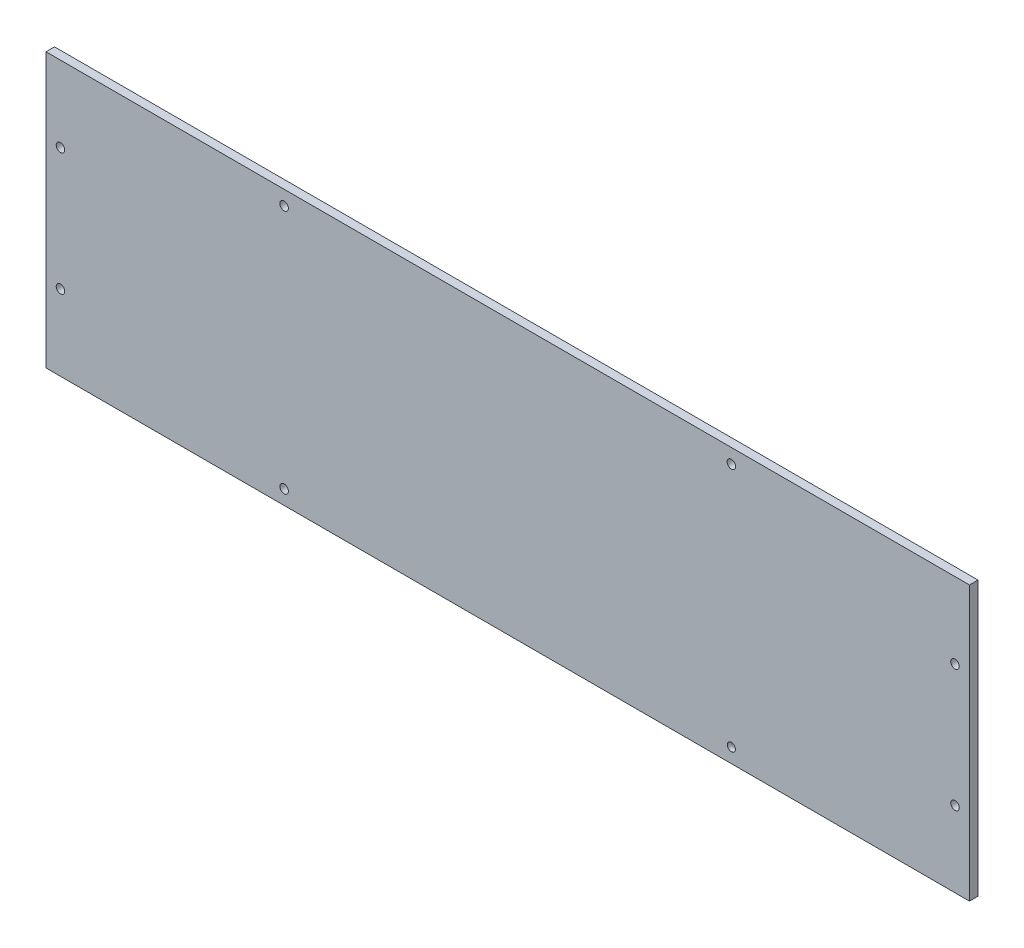
ISO-10303-21;
HEADER;
FILE_DESCRIPTION(('STEP AP214'),'2;1');
FILE_NAME('part.step','',(''),(''),'','','');
FILE_SCHEMA(('AUTOMOTIVE_DESIGN { 1 0 10303 214 1 1 1 1 }'));
ENDSEC;
DATA;
#1=APPLICATION_CONTEXT('core data for automotive mechanical design processes');
#2=APPLICATION_PROTOCOL_DEFINITION('international standard','automotive_design',2000,#1);
#3=PRODUCT_CONTEXT('',#1,'mechanical');
#4=PRODUCT('Part','Part','',(#3));
#5=PRODUCT_RELATED_PRODUCT_CATEGORY('part','',(#4));
#6=PRODUCT_DEFINITION_FORMATION('','',#4);
#7=PRODUCT_DEFINITION_CONTEXT('part definition',#1,'design');
#8=PRODUCT_DEFINITION('design','',#6,#7);
#9=PRODUCT_DEFINITION_SHAPE('','',#8);
#10=(LENGTH_UNIT() NAMED_UNIT(*) SI_UNIT(.MILLI.,.METRE.));
#11=(NAMED_UNIT(*) PLANE_ANGLE_UNIT() SI_UNIT($,.RADIAN.));
#12=(NAMED_UNIT(*) SI_UNIT($,.STERADIAN.) SOLID_ANGLE_UNIT());
#13=UNCERTAINTY_MEASURE_WITH_UNIT(LENGTH_MEASURE(1.E-05),#10,'distance_accuracy_value','');
#14=(GEOMETRIC_REPRESENTATION_CONTEXT(3) GLOBAL_UNCERTAINTY_ASSIGNED_CONTEXT((#13)) GLOBAL_UNIT_ASSIGNED_CONTEXT((#10,
#11,#12)) REPRESENTATION_CONTEXT('',''));
#15=CARTESIAN_POINT('',(0.,0.,0.));
#16=DIRECTION('',(0.,0.,1.));
#17=DIRECTION('',(1.,0.,0.));
#18=AXIS2_PLACEMENT_3D('',#15,#16,#17);
#19=CARTESIAN_POINT('',(0.,0.,0.));
#20=DIRECTION('',(0.,0.,1.));
#21=DIRECTION('',(1.,0.,0.));
#22=AXIS2_PLACEMENT_3D('',#19,#20,#21);
#23=PLANE('',#22);
#24=CARTESIAN_POINT('',(83.79402995,91.2808,0.));
#25=DIRECTION('',(0.,0.,1.));
#26=DIRECTION('',(1.,0.,0.));
#27=AXIS2_PLACEMENT_3D('',#24,#25,#26);
#28=CIRCLE('',#27,1.5);
#29=CARTESIAN_POINT('',(85.29402995,91.2808,0.));
#30=VERTEX_POINT('',#29);
#31=EDGE_CURVE('E104',#30,#30,#28,.T.);
#32=ORIENTED_EDGE('',*,*,#31,.T.);
#33=EDGE_LOOP('',(#32));
#34=FACE_BOUND('',#33,.T.);
#35=CARTESIAN_POINT('',(241.19467665,91.2808,0.));
#36=DIRECTION('',(0.,0.,1.));
#37=DIRECTION('',(1.,0.,0.));
#38=AXIS2_PLACEMENT_3D('',#35,#36,#37);
#39=CIRCLE('',#38,1.5);
#40=CARTESIAN_POINT('',(242.69467665,91.2808,0.));
#41=VERTEX_POINT('',#40);
#42=EDGE_CURVE('E121',#41,#41,#39,.T.);
#43=ORIENTED_EDGE('',*,*,#42,.T.);
#44=EDGE_LOOP('',(#43));
#45=FACE_BOUND('',#44,.T.);
#46=CARTESIAN_POINT('',(319.895,69.7305816,0.));
#47=DIRECTION('',(0.,0.,1.));
#48=DIRECTION('',(1.,0.,0.));
#49=AXIS2_PLACEMENT_3D('',#46,#47,#48);
#50=CIRCLE('',#49,1.50000000000002);
#51=CARTESIAN_POINT('',(321.395,69.7305816,0.));
#52=VERTEX_POINT('',#51);
#53=EDGE_CURVE('E118',#52,#52,#50,.T.);
#54=ORIENTED_EDGE('',*,*,#53,.T.);
#55=EDGE_LOOP('',(#54));
#56=FACE_BOUND('',#55,.T.);
#57=CARTESIAN_POINT('',(319.895,26.6301448000001,0.));
#58=DIRECTION('',(0.,0.,1.));
#59=DIRECTION('',(1.,0.,0.));
#60=AXIS2_PLACEMENT_3D('',#57,#58,#59);
#61=CIRCLE('',#60,1.50000000000002);
#62=CARTESIAN_POINT('',(321.395,26.6301448000001,0.));
#63=VERTEX_POINT('',#62);
#64=EDGE_CURVE('E115',#63,#63,#61,.T.);
#65=ORIENTED_EDGE('',*,*,#64,.T.);
#66=EDGE_LOOP('',(#65));
#67=FACE_BOUND('',#66,.T.);
#68=CARTESIAN_POINT('',(241.19467665,5.0799264,0.));
#69=DIRECTION('',(0.,0.,1.));
#70=DIRECTION('',(1.,0.,0.));
#71=AXIS2_PLACEMENT_3D('',#68,#69,#70);
#72=CIRCLE('',#71,1.5);
#73=CARTESIAN_POINT('',(242.69467665,5.0799264,0.));
#74=VERTEX_POINT('',#73);
#75=EDGE_CURVE('E112',#74,#74,#72,.T.);
#76=ORIENTED_EDGE('',*,*,#75,.T.);
#77=EDGE_LOOP('',(#76));
#78=FACE_BOUND('',#77,.T.);
#79=CARTESIAN_POINT('',(83.79402995,5.0799264,0.));
#80=DIRECTION('',(0.,0.,1.));
#81=DIRECTION('',(1.,0.,0.));
#82=AXIS2_PLACEMENT_3D('',#79,#80,#81);
#83=CIRCLE('',#82,1.5);
#84=CARTESIAN_POINT('',(85.29402995,5.0799264,0.));
#85=VERTEX_POINT('',#84);
#86=EDGE_CURVE('E109',#85,#85,#83,.T.);
#87=ORIENTED_EDGE('',*,*,#86,.T.);
#88=EDGE_LOOP('',(#87));
#89=FACE_BOUND('',#88,.T.);
#90=CARTESIAN_POINT('',(5.0937066,26.6301448,0.));
#91=DIRECTION('',(0.,0.,1.));
#92=DIRECTION('',(1.,0.,0.));
#93=AXIS2_PLACEMENT_3D('',#90,#91,#92);
#94=CIRCLE('',#93,1.5);
#95=CARTESIAN_POINT('',(6.5937066,26.6301448,0.));
#96=VERTEX_POINT('',#95);
#97=EDGE_CURVE('E105',#96,#96,#94,.T.);
#98=ORIENTED_EDGE('',*,*,#97,.T.);
#99=EDGE_LOOP('',(#98));
#100=FACE_BOUND('',#99,.T.);
#101=CARTESIAN_POINT('',(5.09370659999997,69.7305816,0.));
#102=DIRECTION('',(0.,0.,1.));
#103=DIRECTION('',(1.,0.,0.));
#104=AXIS2_PLACEMENT_3D('',#101,#102,#103);
#105=CIRCLE('',#104,1.5);
#106=CARTESIAN_POINT('',(6.59370659999997,69.7305816,0.));
#107=VERTEX_POINT('',#106);
#108=EDGE_CURVE('E108',#107,#107,#105,.T.);
#109=ORIENTED_EDGE('',*,*,#108,.T.);
#110=EDGE_LOOP('',(#109));
#111=FACE_BOUND('',#110,.T.);
#112=DIRECTION('',(0.,-1.,0.));
#113=VECTOR('',#112,1.);
#114=CARTESIAN_POINT('',(0.,0.,0.));
#115=LINE('',#114,#113);
#116=CARTESIAN_POINT('',(0.,96.3745066000003,0.));
#117=VERTEX_POINT('',#116);
#118=CARTESIAN_POINT('',(0.,0.,0.));
#119=VERTEX_POINT('',#118);
#120=EDGE_CURVE('E77',#117,#119,#115,.T.);
#121=ORIENTED_EDGE('',*,*,#120,.F.);
#122=DIRECTION('',(-1.,0.,0.));
#123=VECTOR('',#122,1.);
#124=CARTESIAN_POINT('',(0.,96.3745066000003,0.));
#125=LINE('',#124,#123);
#126=CARTESIAN_POINT('',(324.9887066,96.3745066000003,0.));
#127=VERTEX_POINT('',#126);
#128=EDGE_CURVE('E82',#127,#117,#125,.T.);
#129=ORIENTED_EDGE('',*,*,#128,.F.);
#130=DIRECTION('',(0.,1.,0.));
#131=VECTOR('',#130,1.);
#132=CARTESIAN_POINT('',(324.9887066,0.,0.));
#133=LINE('',#132,#131);
#134=CARTESIAN_POINT('',(324.9887066,0.,0.));
#135=VERTEX_POINT('',#134);
#136=EDGE_CURVE('E134',#135,#127,#133,.T.);
#137=ORIENTED_EDGE('',*,*,#136,.F.);
#138=DIRECTION('',(1.,0.,0.));
#139=VECTOR('',#138,1.);
#140=CARTESIAN_POINT('',(0.,0.,0.));
#141=LINE('',#140,#139);
#142=EDGE_CURVE('E132',#119,#135,#141,.T.);
#143=ORIENTED_EDGE('',*,*,#142,.F.);
#144=EDGE_LOOP('',(#121,#129,#137,#143));
#145=FACE_BOUND('',#144,.T.);
#146=ADVANCED_FACE('F35',(#34,#45,#56,#67,#78,#89,#100,#111,#145),#23,.F.);
#147=CARTESIAN_POINT('',(0.,0.,0.));
#148=DIRECTION('',(-1.,0.,0.));
#149=DIRECTION('',(0.,0.,1.));
#150=AXIS2_PLACEMENT_3D('',#147,#148,#149);
#151=PLANE('',#150);
#152=DIRECTION('',(0.,0.,1.));
#153=VECTOR('',#152,1.);
#154=CARTESIAN_POINT('',(0.,0.,0.));
#155=LINE('',#154,#153);
#156=CARTESIAN_POINT('',(0.,0.,3.));
#157=VERTEX_POINT('',#156);
#158=EDGE_CURVE('E38',#119,#157,#155,.T.);
#159=ORIENTED_EDGE('',*,*,#158,.T.);
#160=DIRECTION('',(0.,-1.,0.));
#161=VECTOR('',#160,1.);
#162=CARTESIAN_POINT('',(0.,96.3745066000003,3.));
#163=LINE('',#162,#161);
#164=CARTESIAN_POINT('',(0.,96.3745066000003,3.));
#165=VERTEX_POINT('',#164);
#166=EDGE_CURVE('E76',#165,#157,#163,.T.);
#167=ORIENTED_EDGE('',*,*,#166,.F.);
#168=DIRECTION('',(0.,0.,1.));
#169=VECTOR('',#168,1.);
#170=CARTESIAN_POINT('',(0.,96.3745066000003,0.));
#171=LINE('',#170,#169);
#172=EDGE_CURVE('E11',#117,#165,#171,.T.);
#173=ORIENTED_EDGE('',*,*,#172,.F.);
#174=ORIENTED_EDGE('',*,*,#120,.T.);
#175=EDGE_LOOP('',(#159,#167,#173,#174));
#176=FACE_BOUND('',#175,.T.);
#177=ADVANCED_FACE('F74',(#176),#151,.T.);
#178=CARTESIAN_POINT('',(0.,96.3745066000003,0.));
#179=DIRECTION('',(0.,1.,0.));
#180=DIRECTION('',(0.,0.,1.));
#181=AXIS2_PLACEMENT_3D('',#178,#179,#180);
#182=PLANE('',#181);
#183=ORIENTED_EDGE('',*,*,#172,.T.);
#184=DIRECTION('',(-1.,0.,0.));
#185=VECTOR('',#184,1.);
#186=CARTESIAN_POINT('',(0.,96.3745066000003,3.));
#187=LINE('',#186,#185);
#188=CARTESIAN_POINT('',(324.9887066,96.3745066000003,3.));
#189=VERTEX_POINT('',#188);
#190=EDGE_CURVE('E94',#189,#165,#187,.T.);
#191=ORIENTED_EDGE('',*,*,#190,.F.);
#192=DIRECTION('',(0.,0.,1.));
#193=VECTOR('',#192,1.);
#194=CARTESIAN_POINT('',(324.9887066,96.3745066000003,0.));
#195=LINE('',#194,#193);
#196=EDGE_CURVE('E43',#127,#189,#195,.T.);
#197=ORIENTED_EDGE('',*,*,#196,.F.);
#198=ORIENTED_EDGE('',*,*,#128,.T.);
#199=EDGE_LOOP('',(#183,#191,#197,#198));
#200=FACE_BOUND('',#199,.T.);
#201=ADVANCED_FACE('F141',(#200),#182,.T.);
#202=CARTESIAN_POINT('',(324.9887066,0.,0.));
#203=DIRECTION('',(1.,0.,0.));
#204=DIRECTION('',(0.,0.,-1.));
#205=AXIS2_PLACEMENT_3D('',#202,#203,#204);
#206=PLANE('',#205);
#207=ORIENTED_EDGE('',*,*,#196,.T.);
#208=DIRECTION('',(0.,1.,0.));
#209=VECTOR('',#208,1.);
#210=CARTESIAN_POINT('',(324.9887066,96.3745066000003,3.));
#211=LINE('',#210,#209);
#212=CARTESIAN_POINT('',(324.9887066,0.,3.));
#213=VERTEX_POINT('',#212);
#214=EDGE_CURVE('E89',#213,#189,#211,.T.);
#215=ORIENTED_EDGE('',*,*,#214,.F.);
#216=DIRECTION('',(0.,0.,1.));
#217=VECTOR('',#216,1.);
#218=CARTESIAN_POINT('',(324.9887066,0.,0.));
#219=LINE('',#218,#217);
#220=EDGE_CURVE('E81',#135,#213,#219,.T.);
#221=ORIENTED_EDGE('',*,*,#220,.F.);
#222=ORIENTED_EDGE('',*,*,#136,.T.);
#223=EDGE_LOOP('',(#207,#215,#221,#222));
#224=FACE_BOUND('',#223,.T.);
#225=ADVANCED_FACE('F138',(#224),#206,.T.);
#226=CARTESIAN_POINT('',(0.,0.,0.));
#227=DIRECTION('',(0.,-1.,0.));
#228=DIRECTION('',(0.,0.,-1.));
#229=AXIS2_PLACEMENT_3D('',#226,#227,#228);
#230=PLANE('',#229);
#231=ORIENTED_EDGE('',*,*,#220,.T.);
#232=DIRECTION('',(1.,0.,0.));
#233=VECTOR('',#232,1.);
#234=CARTESIAN_POINT('',(0.,0.,3.));
#235=LINE('',#234,#233);
#236=EDGE_CURVE('E84',#157,#213,#235,.T.);
#237=ORIENTED_EDGE('',*,*,#236,.F.);
#238=ORIENTED_EDGE('',*,*,#158,.F.);
#239=ORIENTED_EDGE('',*,*,#142,.T.);
#240=EDGE_LOOP('',(#231,#237,#238,#239));
#241=FACE_BOUND('',#240,.T.);
#242=ADVANCED_FACE('F85',(#241),#230,.T.);
#243=CARTESIAN_POINT('',(5.09370659999997,69.7305816,2.54));
#244=DIRECTION('',(0.,0.,-1.));
#245=DIRECTION('',(-1.,0.,0.));
#246=AXIS2_PLACEMENT_3D('',#243,#244,#245);
#247=CYLINDRICAL_SURFACE('',#246,1.5);
#248=ORIENTED_EDGE('',*,*,#108,.F.);
#249=EDGE_LOOP('',(#248));
#250=FACE_BOUND('',#249,.T.);
#251=CARTESIAN_POINT('',(5.09370659999997,69.7305816,3.));
#252=DIRECTION('',(0.,0.,1.));
#253=DIRECTION('',(1.,0.,0.));
#254=AXIS2_PLACEMENT_3D('',#251,#252,#253);
#255=CIRCLE('',#254,1.5);
#256=CARTESIAN_POINT('',(6.59370659999997,69.7305816,3.));
#257=VERTEX_POINT('',#256);
#258=EDGE_CURVE('E172',#257,#257,#255,.T.);
#259=ORIENTED_EDGE('',*,*,#258,.T.);
#260=EDGE_LOOP('',(#259));
#261=FACE_BOUND('',#260,.T.);
#262=ADVANCED_FACE('F165',(#250,#261),#247,.F.);
#263=CARTESIAN_POINT('',(5.0937066,26.6301448,2.54));
#264=DIRECTION('',(0.,0.,-1.));
#265=DIRECTION('',(-1.,0.,0.));
#266=AXIS2_PLACEMENT_3D('',#263,#264,#265);
#267=CYLINDRICAL_SURFACE('',#266,1.5);
#268=ORIENTED_EDGE('',*,*,#97,.F.);
#269=EDGE_LOOP('',(#268));
#270=FACE_BOUND('',#269,.T.);
#271=CARTESIAN_POINT('',(5.0937066,26.6301448,3.));
#272=DIRECTION('',(0.,0.,1.));
#273=DIRECTION('',(1.,0.,0.));
#274=AXIS2_PLACEMENT_3D('',#271,#272,#273);
#275=CIRCLE('',#274,1.5);
#276=CARTESIAN_POINT('',(6.5937066,26.6301448,3.));
#277=VERTEX_POINT('',#276);
#278=EDGE_CURVE('E182',#277,#277,#275,.T.);
#279=ORIENTED_EDGE('',*,*,#278,.T.);
#280=EDGE_LOOP('',(#279));
#281=FACE_BOUND('',#280,.T.);
#282=ADVANCED_FACE('F168',(#270,#281),#267,.F.);
#283=CARTESIAN_POINT('',(83.79402995,5.0799264,2.54));
#284=DIRECTION('',(0.,0.,-1.));
#285=DIRECTION('',(-1.,0.,0.));
#286=AXIS2_PLACEMENT_3D('',#283,#284,#285);
#287=CYLINDRICAL_SURFACE('',#286,1.5);
#288=ORIENTED_EDGE('',*,*,#86,.F.);
#289=EDGE_LOOP('',(#288));
#290=FACE_BOUND('',#289,.T.);
#291=CARTESIAN_POINT('',(83.79402995,5.0799264,3.));
#292=DIRECTION('',(0.,0.,1.));
#293=DIRECTION('',(1.,0.,0.));
#294=AXIS2_PLACEMENT_3D('',#291,#292,#293);
#295=CIRCLE('',#294,1.5);
#296=CARTESIAN_POINT('',(85.29402995,5.0799264,3.));
#297=VERTEX_POINT('',#296);
#298=EDGE_CURVE('E177',#297,#297,#295,.T.);
#299=ORIENTED_EDGE('',*,*,#298,.T.);
#300=EDGE_LOOP('',(#299));
#301=FACE_BOUND('',#300,.T.);
#302=ADVANCED_FACE('F207',(#290,#301),#287,.F.);
#303=CARTESIAN_POINT('',(241.19467665,5.0799264,2.54));
#304=DIRECTION('',(0.,0.,-1.));
#305=DIRECTION('',(-1.,0.,0.));
#306=AXIS2_PLACEMENT_3D('',#303,#304,#305);
#307=CYLINDRICAL_SURFACE('',#306,1.5);
#308=CARTESIAN_POINT('',(241.19467665,5.0799264,1.5));
#309=DIRECTION('',(0.,0.,1.));
#310=DIRECTION('',(1.,0.,0.));
#311=AXIS2_PLACEMENT_3D('',#308,#309,#310);
#312=CIRCLE('',#311,1.5);
#313=CARTESIAN_POINT('',(242.69467665,5.0799264,1.5));
#314=VERTEX_POINT('',#313);
#315=EDGE_CURVE('E128',#314,#314,#312,.F.);
#316=ORIENTED_EDGE('',*,*,#315,.F.);
#317=EDGE_LOOP('',(#316));
#318=FACE_BOUND('',#317,.T.);
#319=ORIENTED_EDGE('',*,*,#75,.F.);
#320=EDGE_LOOP('',(#319));
#321=FACE_BOUND('',#320,.T.);
#322=ADVANCED_FACE('F209',(#318,#321),#307,.F.);
#323=CARTESIAN_POINT('',(319.895,26.6301448000001,2.54));
#324=DIRECTION('',(0.,0.,-1.));
#325=DIRECTION('',(-1.,0.,0.));
#326=AXIS2_PLACEMENT_3D('',#323,#324,#325);
#327=CYLINDRICAL_SURFACE('',#326,1.50000000000002);
#328=ORIENTED_EDGE('',*,*,#64,.F.);
#329=EDGE_LOOP('',(#328));
#330=FACE_BOUND('',#329,.T.);
#331=CARTESIAN_POINT('',(319.895,26.6301448000001,3.));
#332=DIRECTION('',(0.,0.,1.));
#333=DIRECTION('',(1.,0.,0.));
#334=AXIS2_PLACEMENT_3D('',#331,#332,#333);
#335=CIRCLE('',#334,1.50000000000002);
#336=CARTESIAN_POINT('',(321.395,26.6301448000001,3.));
#337=VERTEX_POINT('',#336);
#338=EDGE_CURVE('E98',#337,#337,#335,.T.);
#339=ORIENTED_EDGE('',*,*,#338,.T.);
#340=EDGE_LOOP('',(#339));
#341=FACE_BOUND('',#340,.T.);
#342=ADVANCED_FACE('F196',(#330,#341),#327,.F.);
#343=CARTESIAN_POINT('',(319.895,69.7305816,2.54));
#344=DIRECTION('',(0.,0.,-1.));
#345=DIRECTION('',(-1.,0.,0.));
#346=AXIS2_PLACEMENT_3D('',#343,#344,#345);
#347=CYLINDRICAL_SURFACE('',#346,1.50000000000002);
#348=ORIENTED_EDGE('',*,*,#53,.F.);
#349=EDGE_LOOP('',(#348));
#350=FACE_BOUND('',#349,.T.);
#351=CARTESIAN_POINT('',(319.895,69.7305816,3.));
#352=DIRECTION('',(0.,0.,1.));
#353=DIRECTION('',(1.,0.,0.));
#354=AXIS2_PLACEMENT_3D('',#351,#352,#353);
#355=CIRCLE('',#354,1.50000000000002);
#356=CARTESIAN_POINT('',(321.395,69.7305816,3.));
#357=VERTEX_POINT('',#356);
#358=EDGE_CURVE('E95',#357,#357,#355,.T.);
#359=ORIENTED_EDGE('',*,*,#358,.T.);
#360=EDGE_LOOP('',(#359));
#361=FACE_BOUND('',#360,.T.);
#362=ADVANCED_FACE('F223',(#350,#361),#347,.F.);
#363=CARTESIAN_POINT('',(241.19467665,91.2808,2.54));
#364=DIRECTION('',(0.,0.,-1.));
#365=DIRECTION('',(-1.,0.,0.));
#366=AXIS2_PLACEMENT_3D('',#363,#364,#365);
#367=CYLINDRICAL_SURFACE('',#366,1.5);
#368=ORIENTED_EDGE('',*,*,#42,.F.);
#369=EDGE_LOOP('',(#368));
#370=FACE_BOUND('',#369,.T.);
#371=CARTESIAN_POINT('',(241.19467665,91.2808,3.));
#372=DIRECTION('',(0.,0.,1.));
#373=DIRECTION('',(1.,0.,0.));
#374=AXIS2_PLACEMENT_3D('',#371,#372,#373);
#375=CIRCLE('',#374,1.50000000000002);
#376=CARTESIAN_POINT('',(242.69467665,91.2808,3.));
#377=VERTEX_POINT('',#376);
#378=EDGE_CURVE('E185',#377,#377,#375,.T.);
#379=ORIENTED_EDGE('',*,*,#378,.T.);
#380=EDGE_LOOP('',(#379));
#381=FACE_BOUND('',#380,.T.);
#382=ADVANCED_FACE('F227',(#370,#381),#367,.F.);
#383=CARTESIAN_POINT('',(83.79402995,91.2808,2.54));
#384=DIRECTION('',(0.,0.,-1.));
#385=DIRECTION('',(-1.,0.,0.));
#386=AXIS2_PLACEMENT_3D('',#383,#384,#385);
#387=CYLINDRICAL_SURFACE('',#386,1.5);
#388=ORIENTED_EDGE('',*,*,#31,.F.);
#389=EDGE_LOOP('',(#388));
#390=FACE_BOUND('',#389,.T.);
#391=CARTESIAN_POINT('',(83.79402995,91.2808,3.));
#392=DIRECTION('',(0.,0.,1.));
#393=DIRECTION('',(1.,0.,0.));
#394=AXIS2_PLACEMENT_3D('',#391,#392,#393);
#395=CIRCLE('',#394,1.5);
#396=CARTESIAN_POINT('',(85.29402995,91.2808,3.));
#397=VERTEX_POINT('',#396);
#398=EDGE_CURVE('E174',#397,#397,#395,.T.);
#399=ORIENTED_EDGE('',*,*,#398,.T.);
#400=EDGE_LOOP('',(#399));
#401=FACE_BOUND('',#400,.T.);
#402=ADVANCED_FACE('F231',(#390,#401),#387,.F.);
#403=CARTESIAN_POINT('',(0.,0.,1.5));
#404=DIRECTION('',(0.,0.,1.));
#405=DIRECTION('',(1.,0.,0.));
#406=AXIS2_PLACEMENT_3D('',#403,#404,#405);
#407=PLANE('',#406);
#408=CARTESIAN_POINT('',(241.19467665,5.0799264,1.5));
#409=DIRECTION('',(0.,0.,1.));
#410=DIRECTION('',(1.,0.,0.));
#411=AXIS2_PLACEMENT_3D('',#408,#409,#410);
#412=CIRCLE('',#411,1.43796867212764);
#413=CARTESIAN_POINT('',(242.632645322128,5.0799264,1.5));
#414=VERTEX_POINT('',#413);
#415=EDGE_CURVE('E188',#414,#414,#412,.T.);
#416=ORIENTED_EDGE('',*,*,#415,.T.);
#417=EDGE_LOOP('',(#416));
#418=FACE_BOUND('',#417,.T.);
#419=ORIENTED_EDGE('',*,*,#315,.T.);
#420=EDGE_LOOP('',(#419));
#421=FACE_BOUND('',#420,.T.);
#422=ADVANCED_FACE('F200',(#418,#421),#407,.F.);
#423=CARTESIAN_POINT('',(0.,0.,3.));
#424=DIRECTION('',(0.,0.,1.));
#425=DIRECTION('',(1.,0.,0.));
#426=AXIS2_PLACEMENT_3D('',#423,#424,#425);
#427=PLANE('',#426);
#428=ORIENTED_EDGE('',*,*,#398,.F.);
#429=EDGE_LOOP('',(#428));
#430=FACE_BOUND('',#429,.T.);
#431=ORIENTED_EDGE('',*,*,#278,.F.);
#432=EDGE_LOOP('',(#431));
#433=FACE_BOUND('',#432,.T.);
#434=CARTESIAN_POINT('',(241.19467665,5.0799264,3.));
#435=DIRECTION('',(0.,0.,1.));
#436=DIRECTION('',(1.,0.,0.));
#437=AXIS2_PLACEMENT_3D('',#434,#435,#436);
#438=CIRCLE('',#437,1.43796867212764);
#439=CARTESIAN_POINT('',(242.632645322128,5.0799264,3.));
#440=VERTEX_POINT('',#439);
#441=EDGE_CURVE('E189',#440,#440,#438,.T.);
#442=ORIENTED_EDGE('',*,*,#441,.F.);
#443=EDGE_LOOP('',(#442));
#444=FACE_BOUND('',#443,.T.);
#445=ORIENTED_EDGE('',*,*,#358,.F.);
#446=EDGE_LOOP('',(#445));
#447=FACE_BOUND('',#446,.T.);
#448=ORIENTED_EDGE('',*,*,#166,.T.);
#449=ORIENTED_EDGE('',*,*,#236,.T.);
#450=ORIENTED_EDGE('',*,*,#214,.T.);
#451=ORIENTED_EDGE('',*,*,#190,.T.);
#452=EDGE_LOOP('',(#448,#449,#450,#451));
#453=FACE_BOUND('',#452,.T.);
#454=ORIENTED_EDGE('',*,*,#338,.F.);
#455=EDGE_LOOP('',(#454));
#456=FACE_BOUND('',#455,.T.);
#457=ORIENTED_EDGE('',*,*,#378,.F.);
#458=EDGE_LOOP('',(#457));
#459=FACE_BOUND('',#458,.T.);
#460=ORIENTED_EDGE('',*,*,#298,.F.);
#461=EDGE_LOOP('',(#460));
#462=FACE_BOUND('',#461,.T.);
#463=ORIENTED_EDGE('',*,*,#258,.F.);
#464=EDGE_LOOP('',(#463));
#465=FACE_BOUND('',#464,.T.);
#466=ADVANCED_FACE('F92',(#430,#433,#444,#447,#453,#456,#459,#462,#465),#427,.T.);
#467=CARTESIAN_POINT('',(241.19467665,5.0799264,3.));
#468=DIRECTION('',(0.,0.,-1.));
#469=DIRECTION('',(-1.,0.,0.));
#470=AXIS2_PLACEMENT_3D('',#467,#468,#469);
#471=CYLINDRICAL_SURFACE('',#470,1.43796867212764);
#472=ORIENTED_EDGE('',*,*,#441,.T.);
#473=EDGE_LOOP('',(#472));
#474=FACE_BOUND('',#473,.T.);
#475=ORIENTED_EDGE('',*,*,#415,.F.);
#476=EDGE_LOOP('',(#475));
#477=FACE_BOUND('',#476,.T.);
#478=ADVANCED_FACE('F199',(#474,#477),#471,.F.);
#479=CLOSED_SHELL('',(#146,#177,#201,#225,#242,#262,#282,#302,#322,#342,#362,#382,#402,#422,
#466,#478));
#480=MANIFOLD_SOLID_BREP('B2',#479);
#481=ADVANCED_BREP_SHAPE_REPRESENTATION('',(#18,#480),#14);
#482=SHAPE_DEFINITION_REPRESENTATION(#9,#481);
ENDSEC;
END-ISO-10303-21;
